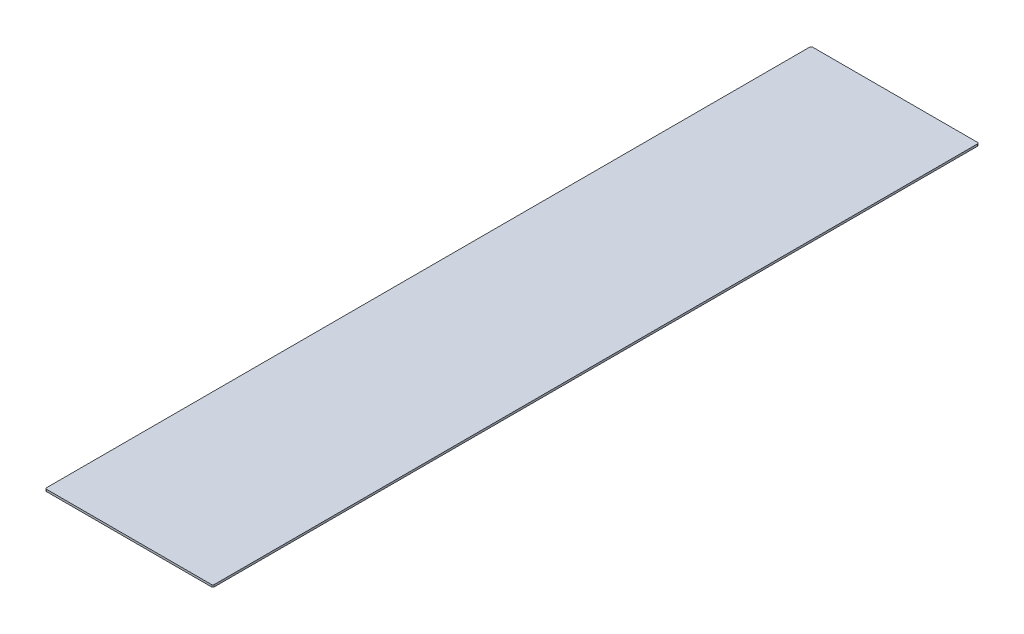
ISO-10303-21;
HEADER;
FILE_DESCRIPTION(('STEP AP214'),'2;1');
FILE_NAME('part.step','',(''),(''),'','','');
FILE_SCHEMA(('AUTOMOTIVE_DESIGN { 1 0 10303 214 1 1 1 1 }'));
ENDSEC;
DATA;
#1=APPLICATION_CONTEXT('core data for automotive mechanical design processes');
#2=APPLICATION_PROTOCOL_DEFINITION('international standard','automotive_design',2000,#1);
#3=PRODUCT_CONTEXT('',#1,'mechanical');
#4=PRODUCT('Part','Part','',(#3));
#5=PRODUCT_RELATED_PRODUCT_CATEGORY('part','',(#4));
#6=PRODUCT_DEFINITION_FORMATION('','',#4);
#7=PRODUCT_DEFINITION_CONTEXT('part definition',#1,'design');
#8=PRODUCT_DEFINITION('design','',#6,#7);
#9=PRODUCT_DEFINITION_SHAPE('','',#8);
#10=(LENGTH_UNIT() NAMED_UNIT(*) SI_UNIT(.MILLI.,.METRE.));
#11=(NAMED_UNIT(*) PLANE_ANGLE_UNIT() SI_UNIT($,.RADIAN.));
#12=(NAMED_UNIT(*) SI_UNIT($,.STERADIAN.) SOLID_ANGLE_UNIT());
#13=UNCERTAINTY_MEASURE_WITH_UNIT(LENGTH_MEASURE(1.E-05),#10,'distance_accuracy_value','');
#14=(GEOMETRIC_REPRESENTATION_CONTEXT(3) GLOBAL_UNCERTAINTY_ASSIGNED_CONTEXT((#13)) GLOBAL_UNIT_ASSIGNED_CONTEXT((#10,
#11,#12)) REPRESENTATION_CONTEXT('',''));
#15=CARTESIAN_POINT('',(0.,0.,0.));
#16=DIRECTION('',(0.,0.,1.));
#17=DIRECTION('',(1.,0.,0.));
#18=AXIS2_PLACEMENT_3D('',#15,#16,#17);
#19=CARTESIAN_POINT('',(-118.75,3.,-549.5));
#20=DIRECTION('',(0.,-1.,0.));
#21=DIRECTION('',(0.,0.,-1.));
#22=AXIS2_PLACEMENT_3D('',#19,#20,#21);
#23=CYLINDRICAL_SURFACE('',#22,1.99999999999999);
#24=CARTESIAN_POINT('',(-118.75,0.,-549.5));
#25=DIRECTION('',(0.,1.,0.));
#26=DIRECTION('',(0.,0.,-1.));
#27=AXIS2_PLACEMENT_3D('',#24,#25,#26);
#28=CIRCLE('',#27,1.99999999999999);
#29=CARTESIAN_POINT('',(-118.75,0.,-551.5));
#30=VERTEX_POINT('',#29);
#31=CARTESIAN_POINT('',(-120.75,0.,-549.5));
#32=VERTEX_POINT('',#31);
#33=EDGE_CURVE('E208',#30,#32,#28,.T.);
#34=ORIENTED_EDGE('',*,*,#33,.T.);
#35=DIRECTION('',(0.,-1.,0.));
#36=VECTOR('',#35,1.);
#37=CARTESIAN_POINT('',(-120.75,3.,-549.5));
#38=LINE('',#37,#36);
#39=CARTESIAN_POINT('',(-120.75,3.,-549.5));
#40=VERTEX_POINT('',#39);
#41=EDGE_CURVE('E12',#40,#32,#38,.T.);
#42=ORIENTED_EDGE('',*,*,#41,.F.);
#43=CARTESIAN_POINT('',(-118.75,3.,-549.5));
#44=DIRECTION('',(0.,1.,0.));
#45=DIRECTION('',(0.,0.,-1.));
#46=AXIS2_PLACEMENT_3D('',#43,#44,#45);
#47=CIRCLE('',#46,1.99999999999999);
#48=CARTESIAN_POINT('',(-118.75,3.,-551.5));
#49=VERTEX_POINT('',#48);
#50=EDGE_CURVE('E162',#49,#40,#47,.T.);
#51=ORIENTED_EDGE('',*,*,#50,.F.);
#52=DIRECTION('',(0.,-1.,0.));
#53=VECTOR('',#52,1.);
#54=CARTESIAN_POINT('',(-118.75,3.,-551.5));
#55=LINE('',#54,#53);
#56=EDGE_CURVE('E137',#49,#30,#55,.T.);
#57=ORIENTED_EDGE('',*,*,#56,.T.);
#58=EDGE_LOOP('',(#34,#42,#51,#57));
#59=FACE_BOUND('',#58,.T.);
#60=ADVANCED_FACE('F40',(#59),#23,.T.);
#61=CARTESIAN_POINT('',(-120.75,3.,549.5));
#62=DIRECTION('',(1.,0.,0.));
#63=DIRECTION('',(0.,0.,-1.));
#64=AXIS2_PLACEMENT_3D('',#61,#62,#63);
#65=PLANE('',#64);
#66=DIRECTION('',(0.,0.,1.));
#67=VECTOR('',#66,1.);
#68=CARTESIAN_POINT('',(-120.75,0.,549.5));
#69=LINE('',#68,#67);
#70=CARTESIAN_POINT('',(-120.75,0.,549.5));
#71=VERTEX_POINT('',#70);
#72=EDGE_CURVE('E199',#32,#71,#69,.T.);
#73=ORIENTED_EDGE('',*,*,#72,.T.);
#74=DIRECTION('',(0.,-1.,0.));
#75=VECTOR('',#74,1.);
#76=CARTESIAN_POINT('',(-120.75,3.,549.5));
#77=LINE('',#76,#75);
#78=CARTESIAN_POINT('',(-120.75,3.,549.5));
#79=VERTEX_POINT('',#78);
#80=EDGE_CURVE('E49',#79,#71,#77,.T.);
#81=ORIENTED_EDGE('',*,*,#80,.F.);
#82=DIRECTION('',(0.,0.,1.));
#83=VECTOR('',#82,1.);
#84=CARTESIAN_POINT('',(-120.75,3.,549.5));
#85=LINE('',#84,#83);
#86=EDGE_CURVE('E100',#40,#79,#85,.T.);
#87=ORIENTED_EDGE('',*,*,#86,.F.);
#88=ORIENTED_EDGE('',*,*,#41,.T.);
#89=EDGE_LOOP('',(#73,#81,#87,#88));
#90=FACE_BOUND('',#89,.T.);
#91=ADVANCED_FACE('F230',(#90),#65,.F.);
#92=CARTESIAN_POINT('',(-118.75,3.,549.5));
#93=DIRECTION('',(0.,-1.,0.));
#94=DIRECTION('',(0.,0.,-1.));
#95=AXIS2_PLACEMENT_3D('',#92,#93,#94);
#96=CYLINDRICAL_SURFACE('',#95,1.99999999999999);
#97=CARTESIAN_POINT('',(-118.75,0.,549.5));
#98=DIRECTION('',(0.,1.,0.));
#99=DIRECTION('',(0.,0.,-1.));
#100=AXIS2_PLACEMENT_3D('',#97,#98,#99);
#101=CIRCLE('',#100,1.99999999999999);
#102=CARTESIAN_POINT('',(-118.75,0.,551.5));
#103=VERTEX_POINT('',#102);
#104=EDGE_CURVE('E194',#71,#103,#101,.T.);
#105=ORIENTED_EDGE('',*,*,#104,.T.);
#106=DIRECTION('',(0.,-1.,0.));
#107=VECTOR('',#106,1.);
#108=CARTESIAN_POINT('',(-118.75,3.,551.5));
#109=LINE('',#108,#107);
#110=CARTESIAN_POINT('',(-118.75,3.,551.5));
#111=VERTEX_POINT('',#110);
#112=EDGE_CURVE('E184',#111,#103,#109,.T.);
#113=ORIENTED_EDGE('',*,*,#112,.F.);
#114=CARTESIAN_POINT('',(-118.75,3.,549.5));
#115=DIRECTION('',(0.,1.,0.));
#116=DIRECTION('',(0.,0.,-1.));
#117=AXIS2_PLACEMENT_3D('',#114,#115,#116);
#118=CIRCLE('',#117,1.99999999999999);
#119=EDGE_CURVE('E154',#79,#111,#118,.T.);
#120=ORIENTED_EDGE('',*,*,#119,.F.);
#121=ORIENTED_EDGE('',*,*,#80,.T.);
#122=EDGE_LOOP('',(#105,#113,#120,#121));
#123=FACE_BOUND('',#122,.T.);
#124=ADVANCED_FACE('F192',(#123),#96,.T.);
#125=CARTESIAN_POINT('',(-118.75,3.,551.5));
#126=DIRECTION('',(0.,0.,-1.));
#127=DIRECTION('',(-1.,0.,0.));
#128=AXIS2_PLACEMENT_3D('',#125,#126,#127);
#129=PLANE('',#128);
#130=DIRECTION('',(1.,0.,0.));
#131=VECTOR('',#130,1.);
#132=CARTESIAN_POINT('',(-118.75,0.,551.5));
#133=LINE('',#132,#131);
#134=CARTESIAN_POINT('',(118.75,0.,551.5));
#135=VERTEX_POINT('',#134);
#136=EDGE_CURVE('E201',#103,#135,#133,.T.);
#137=ORIENTED_EDGE('',*,*,#136,.T.);
#138=DIRECTION('',(0.,-1.,0.));
#139=VECTOR('',#138,1.);
#140=CARTESIAN_POINT('',(118.75,3.,551.5));
#141=LINE('',#140,#139);
#142=CARTESIAN_POINT('',(118.75,3.,551.5));
#143=VERTEX_POINT('',#142);
#144=EDGE_CURVE('E180',#143,#135,#141,.T.);
#145=ORIENTED_EDGE('',*,*,#144,.F.);
#146=DIRECTION('',(1.,0.,0.));
#147=VECTOR('',#146,1.);
#148=CARTESIAN_POINT('',(-118.75,3.,551.5));
#149=LINE('',#148,#147);
#150=EDGE_CURVE('E150',#111,#143,#149,.T.);
#151=ORIENTED_EDGE('',*,*,#150,.F.);
#152=ORIENTED_EDGE('',*,*,#112,.T.);
#153=EDGE_LOOP('',(#137,#145,#151,#152));
#154=FACE_BOUND('',#153,.T.);
#155=ADVANCED_FACE('F237',(#154),#129,.F.);
#156=CARTESIAN_POINT('',(118.75,3.,549.5));
#157=DIRECTION('',(0.,-1.,0.));
#158=DIRECTION('',(0.,0.,-1.));
#159=AXIS2_PLACEMENT_3D('',#156,#157,#158);
#160=CYLINDRICAL_SURFACE('',#159,1.99999999999999);
#161=CARTESIAN_POINT('',(118.75,0.,549.5));
#162=DIRECTION('',(0.,1.,0.));
#163=DIRECTION('',(0.,0.,1.));
#164=AXIS2_PLACEMENT_3D('',#161,#162,#163);
#165=CIRCLE('',#164,1.99999999999999);
#166=CARTESIAN_POINT('',(120.75,0.,549.5));
#167=VERTEX_POINT('',#166);
#168=EDGE_CURVE('E206',#135,#167,#165,.T.);
#169=ORIENTED_EDGE('',*,*,#168,.T.);
#170=DIRECTION('',(0.,-1.,0.));
#171=VECTOR('',#170,1.);
#172=CARTESIAN_POINT('',(120.75,3.,549.5));
#173=LINE('',#172,#171);
#174=CARTESIAN_POINT('',(120.75,3.,549.5));
#175=VERTEX_POINT('',#174);
#176=EDGE_CURVE('E130',#175,#167,#173,.T.);
#177=ORIENTED_EDGE('',*,*,#176,.F.);
#178=CARTESIAN_POINT('',(118.75,3.,549.5));
#179=DIRECTION('',(0.,1.,0.));
#180=DIRECTION('',(0.,0.,1.));
#181=AXIS2_PLACEMENT_3D('',#178,#179,#180);
#182=CIRCLE('',#181,1.99999999999999);
#183=EDGE_CURVE('E119',#143,#175,#182,.T.);
#184=ORIENTED_EDGE('',*,*,#183,.F.);
#185=ORIENTED_EDGE('',*,*,#144,.T.);
#186=EDGE_LOOP('',(#169,#177,#184,#185));
#187=FACE_BOUND('',#186,.T.);
#188=ADVANCED_FACE('F214',(#187),#160,.T.);
#189=CARTESIAN_POINT('',(120.75,3.,549.5));
#190=DIRECTION('',(-1.,0.,0.));
#191=DIRECTION('',(0.,0.,1.));
#192=AXIS2_PLACEMENT_3D('',#189,#190,#191);
#193=PLANE('',#192);
#194=DIRECTION('',(0.,0.,-1.));
#195=VECTOR('',#194,1.);
#196=CARTESIAN_POINT('',(120.75,0.,549.5));
#197=LINE('',#196,#195);
#198=CARTESIAN_POINT('',(120.75,0.,-549.5));
#199=VERTEX_POINT('',#198);
#200=EDGE_CURVE('E128',#167,#199,#197,.T.);
#201=ORIENTED_EDGE('',*,*,#200,.T.);
#202=DIRECTION('',(0.,-1.,0.));
#203=VECTOR('',#202,1.);
#204=CARTESIAN_POINT('',(120.75,3.,-549.5));
#205=LINE('',#204,#203);
#206=CARTESIAN_POINT('',(120.75,3.,-549.5));
#207=VERTEX_POINT('',#206);
#208=EDGE_CURVE('E125',#207,#199,#205,.T.);
#209=ORIENTED_EDGE('',*,*,#208,.F.);
#210=DIRECTION('',(0.,0.,-1.));
#211=VECTOR('',#210,1.);
#212=CARTESIAN_POINT('',(120.75,3.,549.5));
#213=LINE('',#212,#211);
#214=EDGE_CURVE('E113',#175,#207,#213,.T.);
#215=ORIENTED_EDGE('',*,*,#214,.F.);
#216=ORIENTED_EDGE('',*,*,#176,.T.);
#217=EDGE_LOOP('',(#201,#209,#215,#216));
#218=FACE_BOUND('',#217,.T.);
#219=ADVANCED_FACE('F126',(#218),#193,.F.);
#220=CARTESIAN_POINT('',(118.75,3.,-549.5));
#221=DIRECTION('',(0.,-1.,0.));
#222=DIRECTION('',(0.,0.,-1.));
#223=AXIS2_PLACEMENT_3D('',#220,#221,#222);
#224=CYLINDRICAL_SURFACE('',#223,1.99999999999999);
#225=CARTESIAN_POINT('',(118.75,0.,-549.5));
#226=DIRECTION('',(0.,1.,0.));
#227=DIRECTION('',(0.,0.,-1.));
#228=AXIS2_PLACEMENT_3D('',#225,#226,#227);
#229=CIRCLE('',#228,1.99999999999999);
#230=CARTESIAN_POINT('',(118.75,0.,-551.5));
#231=VERTEX_POINT('',#230);
#232=EDGE_CURVE('E86',#199,#231,#229,.T.);
#233=ORIENTED_EDGE('',*,*,#232,.T.);
#234=DIRECTION('',(0.,-1.,0.));
#235=VECTOR('',#234,1.);
#236=CARTESIAN_POINT('',(118.75,3.,-551.5));
#237=LINE('',#236,#235);
#238=CARTESIAN_POINT('',(118.75,3.,-551.5));
#239=VERTEX_POINT('',#238);
#240=EDGE_CURVE('E131',#239,#231,#237,.T.);
#241=ORIENTED_EDGE('',*,*,#240,.F.);
#242=CARTESIAN_POINT('',(118.75,3.,-549.5));
#243=DIRECTION('',(0.,1.,0.));
#244=DIRECTION('',(0.,0.,-1.));
#245=AXIS2_PLACEMENT_3D('',#242,#243,#244);
#246=CIRCLE('',#245,1.99999999999999);
#247=EDGE_CURVE('E117',#207,#239,#246,.T.);
#248=ORIENTED_EDGE('',*,*,#247,.F.);
#249=ORIENTED_EDGE('',*,*,#208,.T.);
#250=EDGE_LOOP('',(#233,#241,#248,#249));
#251=FACE_BOUND('',#250,.T.);
#252=ADVANCED_FACE('F133',(#251),#224,.T.);
#253=CARTESIAN_POINT('',(-118.75,3.,-551.5));
#254=DIRECTION('',(0.,0.,1.));
#255=DIRECTION('',(1.,0.,0.));
#256=AXIS2_PLACEMENT_3D('',#253,#254,#255);
#257=PLANE('',#256);
#258=DIRECTION('',(-1.,0.,0.));
#259=VECTOR('',#258,1.);
#260=CARTESIAN_POINT('',(-118.75,0.,-551.5));
#261=LINE('',#260,#259);
#262=EDGE_CURVE('E92',#231,#30,#261,.T.);
#263=ORIENTED_EDGE('',*,*,#262,.T.);
#264=ORIENTED_EDGE('',*,*,#56,.F.);
#265=DIRECTION('',(-1.,0.,0.));
#266=VECTOR('',#265,1.);
#267=CARTESIAN_POINT('',(-118.75,3.,-551.5));
#268=LINE('',#267,#266);
#269=EDGE_CURVE('E57',#239,#49,#268,.T.);
#270=ORIENTED_EDGE('',*,*,#269,.F.);
#271=ORIENTED_EDGE('',*,*,#240,.T.);
#272=EDGE_LOOP('',(#263,#264,#270,#271));
#273=FACE_BOUND('',#272,.T.);
#274=ADVANCED_FACE('F219',(#273),#257,.F.);
#275=CARTESIAN_POINT('',(-118.75,3.,-549.5));
#276=DIRECTION('',(0.,-1.,0.));
#277=DIRECTION('',(0.,0.,-1.));
#278=AXIS2_PLACEMENT_3D('',#275,#276,#277);
#279=PLANE('',#278);
#280=ORIENTED_EDGE('',*,*,#50,.T.);
#281=ORIENTED_EDGE('',*,*,#86,.T.);
#282=ORIENTED_EDGE('',*,*,#119,.T.);
#283=ORIENTED_EDGE('',*,*,#150,.T.);
#284=ORIENTED_EDGE('',*,*,#183,.T.);
#285=ORIENTED_EDGE('',*,*,#214,.T.);
#286=ORIENTED_EDGE('',*,*,#247,.T.);
#287=ORIENTED_EDGE('',*,*,#269,.T.);
#288=EDGE_LOOP('',(#280,#281,#282,#283,#284,#285,#286,#287));
#289=FACE_BOUND('',#288,.T.);
#290=ADVANCED_FACE('F115',(#289),#279,.F.);
#291=CARTESIAN_POINT('',(-118.75,0.,-549.5));
#292=DIRECTION('',(0.,-1.,0.));
#293=DIRECTION('',(0.,0.,-1.));
#294=AXIS2_PLACEMENT_3D('',#291,#292,#293);
#295=PLANE('',#294);
#296=ORIENTED_EDGE('',*,*,#33,.F.);
#297=ORIENTED_EDGE('',*,*,#262,.F.);
#298=ORIENTED_EDGE('',*,*,#232,.F.);
#299=ORIENTED_EDGE('',*,*,#200,.F.);
#300=ORIENTED_EDGE('',*,*,#168,.F.);
#301=ORIENTED_EDGE('',*,*,#136,.F.);
#302=ORIENTED_EDGE('',*,*,#104,.F.);
#303=ORIENTED_EDGE('',*,*,#72,.F.);
#304=EDGE_LOOP('',(#296,#297,#298,#299,#300,#301,#302,#303));
#305=FACE_BOUND('',#304,.T.);
#306=ADVANCED_FACE('F198',(#305),#295,.T.);
#307=CLOSED_SHELL('',(#60,#91,#124,#155,#188,#219,#252,#274,#290,#306));
#308=MANIFOLD_SOLID_BREP('B2',#307);
#309=ADVANCED_BREP_SHAPE_REPRESENTATION('',(#18,#308),#14);
#310=SHAPE_DEFINITION_REPRESENTATION(#9,#309);
ENDSEC;
END-ISO-10303-21;
